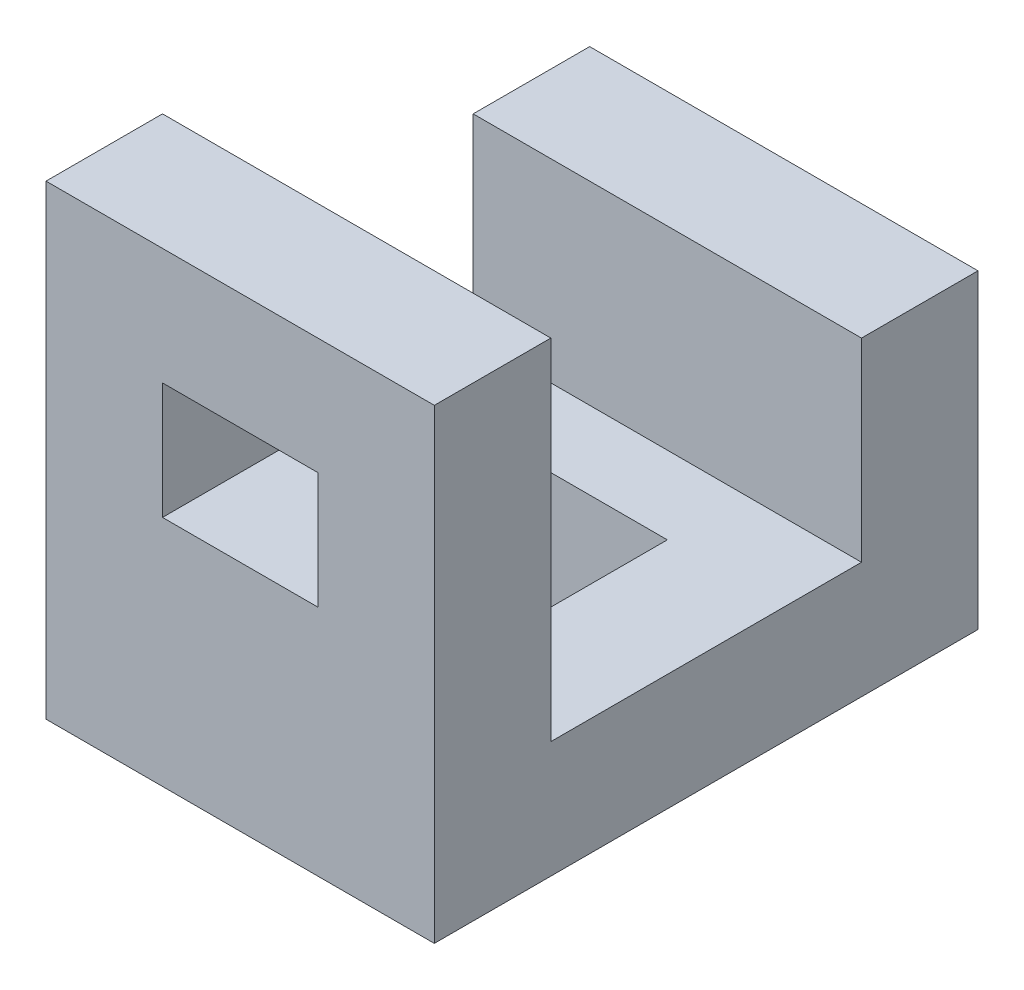
ISO-10303-21;
HEADER;
FILE_DESCRIPTION(('STEP AP214'),'2;1');
FILE_NAME('part.step','',(''),(''),'','','');
FILE_SCHEMA(('AUTOMOTIVE_DESIGN { 1 0 10303 214 1 1 1 1 }'));
ENDSEC;
DATA;
#1=APPLICATION_CONTEXT('core data for automotive mechanical design processes');
#2=APPLICATION_PROTOCOL_DEFINITION('international standard','automotive_design',2000,#1);
#3=PRODUCT_CONTEXT('',#1,'mechanical');
#4=PRODUCT('Part','Part','',(#3));
#5=PRODUCT_RELATED_PRODUCT_CATEGORY('part','',(#4));
#6=PRODUCT_DEFINITION_FORMATION('','',#4);
#7=PRODUCT_DEFINITION_CONTEXT('part definition',#1,'design');
#8=PRODUCT_DEFINITION('design','',#6,#7);
#9=PRODUCT_DEFINITION_SHAPE('','',#8);
#10=(LENGTH_UNIT() NAMED_UNIT(*) SI_UNIT(.MILLI.,.METRE.));
#11=(NAMED_UNIT(*) PLANE_ANGLE_UNIT() SI_UNIT($,.RADIAN.));
#12=(NAMED_UNIT(*) SI_UNIT($,.STERADIAN.) SOLID_ANGLE_UNIT());
#13=UNCERTAINTY_MEASURE_WITH_UNIT(LENGTH_MEASURE(1.E-05),#10,'distance_accuracy_value','');
#14=(GEOMETRIC_REPRESENTATION_CONTEXT(3) GLOBAL_UNCERTAINTY_ASSIGNED_CONTEXT((#13)) GLOBAL_UNIT_ASSIGNED_CONTEXT((#10,
#11,#12)) REPRESENTATION_CONTEXT('',''));
#15=CARTESIAN_POINT('',(0.,0.,0.));
#16=DIRECTION('',(0.,0.,1.));
#17=DIRECTION('',(1.,0.,0.));
#18=AXIS2_PLACEMENT_3D('',#15,#16,#17);
#19=CARTESIAN_POINT('',(0.,60.,-70.));
#20=DIRECTION('',(1.,0.,0.));
#21=DIRECTION('',(0.,0.,-1.));
#22=AXIS2_PLACEMENT_3D('',#19,#20,#21);
#23=PLANE('',#22);
#24=DIRECTION('',(0.,-1.,0.));
#25=VECTOR('',#24,1.);
#26=CARTESIAN_POINT('',(0.,15.,-55.));
#27=LINE('',#26,#25);
#28=CARTESIAN_POINT('',(0.,40.,-55.));
#29=VERTEX_POINT('',#28);
#30=CARTESIAN_POINT('',(0.,15.,-55.));
#31=VERTEX_POINT('',#30);
#32=EDGE_CURVE('E183',#29,#31,#27,.T.);
#33=ORIENTED_EDGE('',*,*,#32,.F.);
#34=DIRECTION('',(0.,0.,1.));
#35=VECTOR('',#34,1.);
#36=CARTESIAN_POINT('',(0.,40.,-55.));
#37=LINE('',#36,#35);
#38=CARTESIAN_POINT('',(0.,40.,-70.));
#39=VERTEX_POINT('',#38);
#40=EDGE_CURVE('E193',#39,#29,#37,.T.);
#41=ORIENTED_EDGE('',*,*,#40,.F.);
#42=DIRECTION('',(0.,-1.,0.));
#43=VECTOR('',#42,1.);
#44=CARTESIAN_POINT('',(0.,60.,-70.));
#45=LINE('',#44,#43);
#46=CARTESIAN_POINT('',(0.,0.,-70.));
#47=VERTEX_POINT('',#46);
#48=EDGE_CURVE('E286',#39,#47,#45,.T.);
#49=ORIENTED_EDGE('',*,*,#48,.T.);
#50=DIRECTION('',(0.,0.,1.));
#51=VECTOR('',#50,1.);
#52=CARTESIAN_POINT('',(0.,0.,-70.));
#53=LINE('',#52,#51);
#54=CARTESIAN_POINT('',(0.,0.,0.));
#55=VERTEX_POINT('',#54);
#56=EDGE_CURVE('E266',#47,#55,#53,.T.);
#57=ORIENTED_EDGE('',*,*,#56,.T.);
#58=DIRECTION('',(0.,-1.,0.));
#59=VECTOR('',#58,1.);
#60=CARTESIAN_POINT('',(0.,60.,0.));
#61=LINE('',#60,#59);
#62=CARTESIAN_POINT('',(0.,60.,0.));
#63=VERTEX_POINT('',#62);
#64=EDGE_CURVE('E309',#63,#55,#61,.T.);
#65=ORIENTED_EDGE('',*,*,#64,.F.);
#66=DIRECTION('',(0.,0.,1.));
#67=VECTOR('',#66,1.);
#68=CARTESIAN_POINT('',(0.,60.,-70.));
#69=LINE('',#68,#67);
#70=CARTESIAN_POINT('',(0.,60.,-15.));
#71=VERTEX_POINT('',#70);
#72=EDGE_CURVE('E275',#71,#63,#69,.T.);
#73=ORIENTED_EDGE('',*,*,#72,.F.);
#74=DIRECTION('',(0.,1.,0.));
#75=VECTOR('',#74,1.);
#76=CARTESIAN_POINT('',(0.,60.,-15.));
#77=LINE('',#76,#75);
#78=CARTESIAN_POINT('',(0.,15.,-15.));
#79=VERTEX_POINT('',#78);
#80=EDGE_CURVE('E213',#79,#71,#77,.T.);
#81=ORIENTED_EDGE('',*,*,#80,.F.);
#82=DIRECTION('',(0.,0.,1.));
#83=VECTOR('',#82,1.);
#84=CARTESIAN_POINT('',(0.,15.,-15.));
#85=LINE('',#84,#83);
#86=EDGE_CURVE('E209',#31,#79,#85,.T.);
#87=ORIENTED_EDGE('',*,*,#86,.F.);
#88=EDGE_LOOP('',(#33,#41,#49,#57,#65,#73,#81,#87));
#89=FACE_BOUND('',#88,.T.);
#90=ADVANCED_FACE('F39',(#89),#23,.F.);
#91=CARTESIAN_POINT('',(0.,60.,0.));
#92=DIRECTION('',(0.,0.,-1.));
#93=DIRECTION('',(-1.,0.,0.));
#94=AXIS2_PLACEMENT_3D('',#91,#92,#93);
#95=PLANE('',#94);
#96=DIRECTION('',(-1.,0.,0.));
#97=VECTOR('',#96,1.);
#98=CARTESIAN_POINT('',(35.,45.,0.));
#99=LINE('',#98,#97);
#100=CARTESIAN_POINT('',(35.,45.,0.));
#101=VERTEX_POINT('',#100);
#102=CARTESIAN_POINT('',(15.,45.,0.));
#103=VERTEX_POINT('',#102);
#104=EDGE_CURVE('E165',#101,#103,#99,.T.);
#105=ORIENTED_EDGE('',*,*,#104,.F.);
#106=DIRECTION('',(0.,1.,0.));
#107=VECTOR('',#106,1.);
#108=CARTESIAN_POINT('',(35.,30.,0.));
#109=LINE('',#108,#107);
#110=CARTESIAN_POINT('',(35.,30.,0.));
#111=VERTEX_POINT('',#110);
#112=EDGE_CURVE('E54',#111,#101,#109,.T.);
#113=ORIENTED_EDGE('',*,*,#112,.F.);
#114=DIRECTION('',(1.,0.,0.));
#115=VECTOR('',#114,1.);
#116=CARTESIAN_POINT('',(15.,30.,0.));
#117=LINE('',#116,#115);
#118=CARTESIAN_POINT('',(15.,30.,0.));
#119=VERTEX_POINT('',#118);
#120=EDGE_CURVE('E173',#119,#111,#117,.T.);
#121=ORIENTED_EDGE('',*,*,#120,.F.);
#122=DIRECTION('',(0.,-1.,0.));
#123=VECTOR('',#122,1.);
#124=CARTESIAN_POINT('',(15.,45.,0.));
#125=LINE('',#124,#123);
#126=EDGE_CURVE('E155',#103,#119,#125,.T.);
#127=ORIENTED_EDGE('',*,*,#126,.F.);
#128=EDGE_LOOP('',(#105,#113,#121,#127));
#129=FACE_BOUND('',#128,.T.);
#130=DIRECTION('',(1.,0.,0.));
#131=VECTOR('',#130,1.);
#132=CARTESIAN_POINT('',(0.,0.,0.));
#133=LINE('',#132,#131);
#134=CARTESIAN_POINT('',(50.,0.,0.));
#135=VERTEX_POINT('',#134);
#136=EDGE_CURVE('E290',#55,#135,#133,.T.);
#137=ORIENTED_EDGE('',*,*,#136,.T.);
#138=DIRECTION('',(0.,-1.,0.));
#139=VECTOR('',#138,1.);
#140=CARTESIAN_POINT('',(50.,60.,0.));
#141=LINE('',#140,#139);
#142=CARTESIAN_POINT('',(50.,60.,0.));
#143=VERTEX_POINT('',#142);
#144=EDGE_CURVE('E305',#143,#135,#141,.T.);
#145=ORIENTED_EDGE('',*,*,#144,.F.);
#146=DIRECTION('',(1.,0.,0.));
#147=VECTOR('',#146,1.);
#148=CARTESIAN_POINT('',(0.,60.,0.));
#149=LINE('',#148,#147);
#150=EDGE_CURVE('E278',#63,#143,#149,.T.);
#151=ORIENTED_EDGE('',*,*,#150,.F.);
#152=ORIENTED_EDGE('',*,*,#64,.T.);
#153=EDGE_LOOP('',(#137,#145,#151,#152));
#154=FACE_BOUND('',#153,.T.);
#155=ADVANCED_FACE('F170',(#129,#154),#95,.F.);
#156=CARTESIAN_POINT('',(50.,60.,0.));
#157=DIRECTION('',(-1.,0.,0.));
#158=DIRECTION('',(0.,0.,1.));
#159=AXIS2_PLACEMENT_3D('',#156,#157,#158);
#160=PLANE('',#159);
#161=DIRECTION('',(0.,-1.,0.));
#162=VECTOR('',#161,1.);
#163=CARTESIAN_POINT('',(50.,60.,-70.));
#164=LINE('',#163,#162);
#165=CARTESIAN_POINT('',(50.,40.,-70.));
#166=VERTEX_POINT('',#165);
#167=CARTESIAN_POINT('',(50.,0.,-70.));
#168=VERTEX_POINT('',#167);
#169=EDGE_CURVE('E302',#166,#168,#164,.T.);
#170=ORIENTED_EDGE('',*,*,#169,.F.);
#171=DIRECTION('',(0.,0.,1.));
#172=VECTOR('',#171,1.);
#173=CARTESIAN_POINT('',(50.,40.,-55.));
#174=LINE('',#173,#172);
#175=CARTESIAN_POINT('',(50.,40.,-55.));
#176=VERTEX_POINT('',#175);
#177=EDGE_CURVE('E201',#166,#176,#174,.T.);
#178=ORIENTED_EDGE('',*,*,#177,.T.);
#179=DIRECTION('',(0.,-1.,0.));
#180=VECTOR('',#179,1.);
#181=CARTESIAN_POINT('',(50.,15.,-55.));
#182=LINE('',#181,#180);
#183=CARTESIAN_POINT('',(50.,15.,-55.));
#184=VERTEX_POINT('',#183);
#185=EDGE_CURVE('E188',#176,#184,#182,.T.);
#186=ORIENTED_EDGE('',*,*,#185,.T.);
#187=DIRECTION('',(0.,0.,1.));
#188=VECTOR('',#187,1.);
#189=CARTESIAN_POINT('',(50.,15.,-15.));
#190=LINE('',#189,#188);
#191=CARTESIAN_POINT('',(50.,15.,-15.));
#192=VERTEX_POINT('',#191);
#193=EDGE_CURVE('E192',#184,#192,#190,.T.);
#194=ORIENTED_EDGE('',*,*,#193,.T.);
#195=DIRECTION('',(0.,1.,0.));
#196=VECTOR('',#195,1.);
#197=CARTESIAN_POINT('',(50.,60.,-15.));
#198=LINE('',#197,#196);
#199=CARTESIAN_POINT('',(50.,60.,-15.));
#200=VERTEX_POINT('',#199);
#201=EDGE_CURVE('E197',#192,#200,#198,.T.);
#202=ORIENTED_EDGE('',*,*,#201,.T.);
#203=DIRECTION('',(0.,0.,-1.));
#204=VECTOR('',#203,1.);
#205=CARTESIAN_POINT('',(50.,60.,0.));
#206=LINE('',#205,#204);
#207=EDGE_CURVE('E282',#143,#200,#206,.T.);
#208=ORIENTED_EDGE('',*,*,#207,.F.);
#209=ORIENTED_EDGE('',*,*,#144,.T.);
#210=DIRECTION('',(0.,0.,-1.));
#211=VECTOR('',#210,1.);
#212=CARTESIAN_POINT('',(50.,0.,0.));
#213=LINE('',#212,#211);
#214=EDGE_CURVE('E293',#135,#168,#213,.T.);
#215=ORIENTED_EDGE('',*,*,#214,.T.);
#216=EDGE_LOOP('',(#170,#178,#186,#194,#202,#208,#209,#215));
#217=FACE_BOUND('',#216,.T.);
#218=ADVANCED_FACE('F346',(#217),#160,.F.);
#219=CARTESIAN_POINT('',(50.,60.,-70.));
#220=DIRECTION('',(0.,0.,1.));
#221=DIRECTION('',(1.,0.,0.));
#222=AXIS2_PLACEMENT_3D('',#219,#220,#221);
#223=PLANE('',#222);
#224=ORIENTED_EDGE('',*,*,#48,.F.);
#225=DIRECTION('',(-1.,0.,0.));
#226=VECTOR('',#225,1.);
#227=CARTESIAN_POINT('',(50.,40.,-70.));
#228=LINE('',#227,#226);
#229=EDGE_CURVE('E223',#166,#39,#228,.T.);
#230=ORIENTED_EDGE('',*,*,#229,.F.);
#231=ORIENTED_EDGE('',*,*,#169,.T.);
#232=DIRECTION('',(-1.,0.,0.));
#233=VECTOR('',#232,1.);
#234=CARTESIAN_POINT('',(50.,0.,-70.));
#235=LINE('',#234,#233);
#236=EDGE_CURVE('E279',#168,#47,#235,.T.);
#237=ORIENTED_EDGE('',*,*,#236,.T.);
#238=EDGE_LOOP('',(#224,#230,#231,#237));
#239=FACE_BOUND('',#238,.T.);
#240=ADVANCED_FACE('F360',(#239),#223,.F.);
#241=CARTESIAN_POINT('',(0.,60.,0.));
#242=DIRECTION('',(0.,1.,0.));
#243=DIRECTION('',(0.,0.,1.));
#244=AXIS2_PLACEMENT_3D('',#241,#242,#243);
#245=PLANE('',#244);
#246=DIRECTION('',(-1.,0.,0.));
#247=VECTOR('',#246,1.);
#248=CARTESIAN_POINT('',(50.,60.,-15.));
#249=LINE('',#248,#247);
#250=EDGE_CURVE('E226',#200,#71,#249,.T.);
#251=ORIENTED_EDGE('',*,*,#250,.T.);
#252=ORIENTED_EDGE('',*,*,#72,.T.);
#253=ORIENTED_EDGE('',*,*,#150,.T.);
#254=ORIENTED_EDGE('',*,*,#207,.T.);
#255=EDGE_LOOP('',(#251,#252,#253,#254));
#256=FACE_BOUND('',#255,.T.);
#257=ADVANCED_FACE('F373',(#256),#245,.T.);
#258=CARTESIAN_POINT('',(0.,0.,0.));
#259=DIRECTION('',(0.,1.,0.));
#260=DIRECTION('',(0.,0.,1.));
#261=AXIS2_PLACEMENT_3D('',#258,#259,#260);
#262=PLANE('',#261);
#263=DIRECTION('',(0.,0.,-1.));
#264=VECTOR('',#263,1.);
#265=CARTESIAN_POINT('',(15.,0.,-25.));
#266=LINE('',#265,#264);
#267=CARTESIAN_POINT('',(15.,0.,-25.));
#268=VERTEX_POINT('',#267);
#269=CARTESIAN_POINT('',(15.,0.,-45.));
#270=VERTEX_POINT('',#269);
#271=EDGE_CURVE('E250',#268,#270,#266,.T.);
#272=ORIENTED_EDGE('',*,*,#271,.F.);
#273=DIRECTION('',(-1.,0.,0.));
#274=VECTOR('',#273,1.);
#275=CARTESIAN_POINT('',(35.,0.,-25.));
#276=LINE('',#275,#274);
#277=CARTESIAN_POINT('',(35.,0.,-25.));
#278=VERTEX_POINT('',#277);
#279=EDGE_CURVE('E246',#278,#268,#276,.T.);
#280=ORIENTED_EDGE('',*,*,#279,.F.);
#281=DIRECTION('',(0.,0.,1.));
#282=VECTOR('',#281,1.);
#283=CARTESIAN_POINT('',(35.,0.,-45.));
#284=LINE('',#283,#282);
#285=CARTESIAN_POINT('',(35.,0.,-45.));
#286=VERTEX_POINT('',#285);
#287=EDGE_CURVE('E258',#286,#278,#284,.T.);
#288=ORIENTED_EDGE('',*,*,#287,.F.);
#289=DIRECTION('',(1.,0.,0.));
#290=VECTOR('',#289,1.);
#291=CARTESIAN_POINT('',(15.,0.,-45.));
#292=LINE('',#291,#290);
#293=EDGE_CURVE('E254',#270,#286,#292,.T.);
#294=ORIENTED_EDGE('',*,*,#293,.F.);
#295=EDGE_LOOP('',(#272,#280,#288,#294));
#296=FACE_BOUND('',#295,.T.);
#297=ORIENTED_EDGE('',*,*,#56,.F.);
#298=ORIENTED_EDGE('',*,*,#236,.F.);
#299=ORIENTED_EDGE('',*,*,#214,.F.);
#300=ORIENTED_EDGE('',*,*,#136,.F.);
#301=EDGE_LOOP('',(#297,#298,#299,#300));
#302=FACE_BOUND('',#301,.T.);
#303=ADVANCED_FACE('F368',(#296,#302),#262,.F.);
#304=CARTESIAN_POINT('',(35.,60.,-25.));
#305=DIRECTION('',(0.,0.,1.));
#306=DIRECTION('',(1.,0.,0.));
#307=AXIS2_PLACEMENT_3D('',#304,#305,#306);
#308=PLANE('',#307);
#309=DIRECTION('',(0.,-1.,0.));
#310=VECTOR('',#309,1.);
#311=CARTESIAN_POINT('',(15.,60.,-25.));
#312=LINE('',#311,#310);
#313=CARTESIAN_POINT('',(15.,15.,-25.));
#314=VERTEX_POINT('',#313);
#315=EDGE_CURVE('E262',#314,#268,#312,.T.);
#316=ORIENTED_EDGE('',*,*,#315,.F.);
#317=DIRECTION('',(1.,0.,0.));
#318=VECTOR('',#317,1.);
#319=CARTESIAN_POINT('',(35.,15.,-25.));
#320=LINE('',#319,#318);
#321=CARTESIAN_POINT('',(35.,15.,-25.));
#322=VERTEX_POINT('',#321);
#323=EDGE_CURVE('E242',#314,#322,#320,.T.);
#324=ORIENTED_EDGE('',*,*,#323,.T.);
#325=DIRECTION('',(0.,-1.,0.));
#326=VECTOR('',#325,1.);
#327=CARTESIAN_POINT('',(35.,60.,-25.));
#328=LINE('',#327,#326);
#329=EDGE_CURVE('E263',#322,#278,#328,.T.);
#330=ORIENTED_EDGE('',*,*,#329,.T.);
#331=ORIENTED_EDGE('',*,*,#279,.T.);
#332=EDGE_LOOP('',(#316,#324,#330,#331));
#333=FACE_BOUND('',#332,.T.);
#334=ADVANCED_FACE('F396',(#333),#308,.F.);
#335=CARTESIAN_POINT('',(35.,60.,-45.));
#336=DIRECTION('',(1.,0.,0.));
#337=DIRECTION('',(0.,0.,-1.));
#338=AXIS2_PLACEMENT_3D('',#335,#336,#337);
#339=PLANE('',#338);
#340=ORIENTED_EDGE('',*,*,#329,.F.);
#341=DIRECTION('',(0.,0.,-1.));
#342=VECTOR('',#341,1.);
#343=CARTESIAN_POINT('',(35.,15.,-45.));
#344=LINE('',#343,#342);
#345=CARTESIAN_POINT('',(35.,15.,-45.));
#346=VERTEX_POINT('',#345);
#347=EDGE_CURVE('E238',#322,#346,#344,.T.);
#348=ORIENTED_EDGE('',*,*,#347,.T.);
#349=DIRECTION('',(0.,-1.,0.));
#350=VECTOR('',#349,1.);
#351=CARTESIAN_POINT('',(35.,60.,-45.));
#352=LINE('',#351,#350);
#353=EDGE_CURVE('E267',#346,#286,#352,.T.);
#354=ORIENTED_EDGE('',*,*,#353,.T.);
#355=ORIENTED_EDGE('',*,*,#287,.T.);
#356=EDGE_LOOP('',(#340,#348,#354,#355));
#357=FACE_BOUND('',#356,.T.);
#358=ADVANCED_FACE('F394',(#357),#339,.F.);
#359=CARTESIAN_POINT('',(15.,60.,-45.));
#360=DIRECTION('',(0.,0.,-1.));
#361=DIRECTION('',(-1.,0.,0.));
#362=AXIS2_PLACEMENT_3D('',#359,#360,#361);
#363=PLANE('',#362);
#364=ORIENTED_EDGE('',*,*,#353,.F.);
#365=DIRECTION('',(-1.,0.,0.));
#366=VECTOR('',#365,1.);
#367=CARTESIAN_POINT('',(15.,15.,-45.));
#368=LINE('',#367,#366);
#369=CARTESIAN_POINT('',(15.,15.,-45.));
#370=VERTEX_POINT('',#369);
#371=EDGE_CURVE('E222',#346,#370,#368,.T.);
#372=ORIENTED_EDGE('',*,*,#371,.T.);
#373=DIRECTION('',(0.,-1.,0.));
#374=VECTOR('',#373,1.);
#375=CARTESIAN_POINT('',(15.,60.,-45.));
#376=LINE('',#375,#374);
#377=EDGE_CURVE('E270',#370,#270,#376,.T.);
#378=ORIENTED_EDGE('',*,*,#377,.T.);
#379=ORIENTED_EDGE('',*,*,#293,.T.);
#380=EDGE_LOOP('',(#364,#372,#378,#379));
#381=FACE_BOUND('',#380,.T.);
#382=ADVANCED_FACE('F386',(#381),#363,.F.);
#383=CARTESIAN_POINT('',(15.,60.,-25.));
#384=DIRECTION('',(-1.,0.,0.));
#385=DIRECTION('',(0.,0.,1.));
#386=AXIS2_PLACEMENT_3D('',#383,#384,#385);
#387=PLANE('',#386);
#388=ORIENTED_EDGE('',*,*,#377,.F.);
#389=DIRECTION('',(0.,0.,1.));
#390=VECTOR('',#389,1.);
#391=CARTESIAN_POINT('',(15.,15.,-25.));
#392=LINE('',#391,#390);
#393=EDGE_CURVE('E313',#370,#314,#392,.T.);
#394=ORIENTED_EDGE('',*,*,#393,.T.);
#395=ORIENTED_EDGE('',*,*,#315,.T.);
#396=ORIENTED_EDGE('',*,*,#271,.T.);
#397=EDGE_LOOP('',(#388,#394,#395,#396));
#398=FACE_BOUND('',#397,.T.);
#399=ADVANCED_FACE('F379',(#398),#387,.F.);
#400=CARTESIAN_POINT('',(50.,15.,-15.));
#401=DIRECTION('',(0.,-1.,0.));
#402=DIRECTION('',(0.,0.,-1.));
#403=AXIS2_PLACEMENT_3D('',#400,#401,#402);
#404=PLANE('',#403);
#405=ORIENTED_EDGE('',*,*,#86,.T.);
#406=DIRECTION('',(-1.,0.,0.));
#407=VECTOR('',#406,1.);
#408=CARTESIAN_POINT('',(50.,15.,-15.));
#409=LINE('',#408,#407);
#410=EDGE_CURVE('E230',#192,#79,#409,.T.);
#411=ORIENTED_EDGE('',*,*,#410,.F.);
#412=ORIENTED_EDGE('',*,*,#193,.F.);
#413=DIRECTION('',(-1.,0.,0.));
#414=VECTOR('',#413,1.);
#415=CARTESIAN_POINT('',(50.,15.,-55.));
#416=LINE('',#415,#414);
#417=EDGE_CURVE('E205',#184,#31,#416,.T.);
#418=ORIENTED_EDGE('',*,*,#417,.T.);
#419=EDGE_LOOP('',(#405,#411,#412,#418));
#420=FACE_BOUND('',#419,.T.);
#421=ORIENTED_EDGE('',*,*,#393,.F.);
#422=ORIENTED_EDGE('',*,*,#371,.F.);
#423=ORIENTED_EDGE('',*,*,#347,.F.);
#424=ORIENTED_EDGE('',*,*,#323,.F.);
#425=EDGE_LOOP('',(#421,#422,#423,#424));
#426=FACE_BOUND('',#425,.T.);
#427=ADVANCED_FACE('F376',(#420,#426),#404,.F.);
#428=CARTESIAN_POINT('',(50.,15.,-55.));
#429=DIRECTION('',(0.,0.,-1.));
#430=DIRECTION('',(-1.,0.,0.));
#431=AXIS2_PLACEMENT_3D('',#428,#429,#430);
#432=PLANE('',#431);
#433=ORIENTED_EDGE('',*,*,#32,.T.);
#434=ORIENTED_EDGE('',*,*,#417,.F.);
#435=ORIENTED_EDGE('',*,*,#185,.F.);
#436=DIRECTION('',(-1.,0.,0.));
#437=VECTOR('',#436,1.);
#438=CARTESIAN_POINT('',(50.,40.,-55.));
#439=LINE('',#438,#437);
#440=EDGE_CURVE('E219',#176,#29,#439,.T.);
#441=ORIENTED_EDGE('',*,*,#440,.T.);
#442=EDGE_LOOP('',(#433,#434,#435,#441));
#443=FACE_BOUND('',#442,.T.);
#444=ADVANCED_FACE('F353',(#443),#432,.F.);
#445=CARTESIAN_POINT('',(50.,40.,-55.));
#446=DIRECTION('',(0.,-1.,0.));
#447=DIRECTION('',(0.,0.,-1.));
#448=AXIS2_PLACEMENT_3D('',#445,#446,#447);
#449=PLANE('',#448);
#450=ORIENTED_EDGE('',*,*,#40,.T.);
#451=ORIENTED_EDGE('',*,*,#440,.F.);
#452=ORIENTED_EDGE('',*,*,#177,.F.);
#453=ORIENTED_EDGE('',*,*,#229,.T.);
#454=EDGE_LOOP('',(#450,#451,#452,#453));
#455=FACE_BOUND('',#454,.T.);
#456=ADVANCED_FACE('F337',(#455),#449,.F.);
#457=CARTESIAN_POINT('',(50.,60.,-15.));
#458=DIRECTION('',(0.,0.,1.));
#459=DIRECTION('',(0.,-1.,0.));
#460=AXIS2_PLACEMENT_3D('',#457,#458,#459);
#461=PLANE('',#460);
#462=DIRECTION('',(1.,0.,0.));
#463=VECTOR('',#462,1.);
#464=CARTESIAN_POINT('',(50.,30.,-15.));
#465=LINE('',#464,#463);
#466=CARTESIAN_POINT('',(15.,30.,-15.));
#467=VERTEX_POINT('',#466);
#468=CARTESIAN_POINT('',(35.,30.,-15.));
#469=VERTEX_POINT('',#468);
#470=EDGE_CURVE('E47',#467,#469,#465,.T.);
#471=ORIENTED_EDGE('',*,*,#470,.T.);
#472=DIRECTION('',(0.,1.,0.));
#473=VECTOR('',#472,1.);
#474=CARTESIAN_POINT('',(35.,60.,-15.));
#475=LINE('',#474,#473);
#476=CARTESIAN_POINT('',(35.,45.,-15.));
#477=VERTEX_POINT('',#476);
#478=EDGE_CURVE('E11',#469,#477,#475,.T.);
#479=ORIENTED_EDGE('',*,*,#478,.T.);
#480=DIRECTION('',(-1.,0.,0.));
#481=VECTOR('',#480,1.);
#482=CARTESIAN_POINT('',(50.,45.,-15.));
#483=LINE('',#482,#481);
#484=CARTESIAN_POINT('',(15.,45.,-15.));
#485=VERTEX_POINT('',#484);
#486=EDGE_CURVE('E317',#477,#485,#483,.T.);
#487=ORIENTED_EDGE('',*,*,#486,.T.);
#488=DIRECTION('',(0.,-1.,0.));
#489=VECTOR('',#488,1.);
#490=CARTESIAN_POINT('',(15.,60.,-15.));
#491=LINE('',#490,#489);
#492=EDGE_CURVE('E158',#485,#467,#491,.T.);
#493=ORIENTED_EDGE('',*,*,#492,.T.);
#494=EDGE_LOOP('',(#471,#479,#487,#493));
#495=FACE_BOUND('',#494,.T.);
#496=ORIENTED_EDGE('',*,*,#80,.T.);
#497=ORIENTED_EDGE('',*,*,#250,.F.);
#498=ORIENTED_EDGE('',*,*,#201,.F.);
#499=ORIENTED_EDGE('',*,*,#410,.T.);
#500=EDGE_LOOP('',(#496,#497,#498,#499));
#501=FACE_BOUND('',#500,.T.);
#502=ADVANCED_FACE('F324',(#495,#501),#461,.F.);
#503=CARTESIAN_POINT('',(35.,30.,-50.));
#504=DIRECTION('',(1.,0.,0.));
#505=DIRECTION('',(0.,1.,0.));
#506=AXIS2_PLACEMENT_3D('',#503,#504,#505);
#507=PLANE('',#506);
#508=DIRECTION('',(0.,0.,1.));
#509=VECTOR('',#508,1.);
#510=CARTESIAN_POINT('',(35.,30.,-50.));
#511=LINE('',#510,#509);
#512=EDGE_CURVE('E180',#469,#111,#511,.T.);
#513=ORIENTED_EDGE('',*,*,#512,.T.);
#514=ORIENTED_EDGE('',*,*,#112,.T.);
#515=DIRECTION('',(0.,0.,1.));
#516=VECTOR('',#515,1.);
#517=CARTESIAN_POINT('',(35.,45.,-50.));
#518=LINE('',#517,#516);
#519=EDGE_CURVE('E162',#477,#101,#518,.T.);
#520=ORIENTED_EDGE('',*,*,#519,.F.);
#521=ORIENTED_EDGE('',*,*,#478,.F.);
#522=EDGE_LOOP('',(#513,#514,#520,#521));
#523=FACE_BOUND('',#522,.T.);
#524=ADVANCED_FACE('F329',(#523),#507,.F.);
#525=CARTESIAN_POINT('',(15.,30.,-50.));
#526=DIRECTION('',(0.,-1.,0.));
#527=DIRECTION('',(1.,0.,0.));
#528=AXIS2_PLACEMENT_3D('',#525,#526,#527);
#529=PLANE('',#528);
#530=DIRECTION('',(0.,0.,1.));
#531=VECTOR('',#530,1.);
#532=CARTESIAN_POINT('',(15.,30.,-50.));
#533=LINE('',#532,#531);
#534=EDGE_CURVE('E161',#467,#119,#533,.T.);
#535=ORIENTED_EDGE('',*,*,#534,.T.);
#536=ORIENTED_EDGE('',*,*,#120,.T.);
#537=ORIENTED_EDGE('',*,*,#512,.F.);
#538=ORIENTED_EDGE('',*,*,#470,.F.);
#539=EDGE_LOOP('',(#535,#536,#537,#538));
#540=FACE_BOUND('',#539,.T.);
#541=ADVANCED_FACE('F328',(#540),#529,.F.);
#542=CARTESIAN_POINT('',(15.,45.,-50.));
#543=DIRECTION('',(-1.,0.,0.));
#544=DIRECTION('',(0.,0.,1.));
#545=AXIS2_PLACEMENT_3D('',#542,#543,#544);
#546=PLANE('',#545);
#547=DIRECTION('',(0.,0.,1.));
#548=VECTOR('',#547,1.);
#549=CARTESIAN_POINT('',(15.,45.,-50.));
#550=LINE('',#549,#548);
#551=EDGE_CURVE('E62',#485,#103,#550,.T.);
#552=ORIENTED_EDGE('',*,*,#551,.T.);
#553=ORIENTED_EDGE('',*,*,#126,.T.);
#554=ORIENTED_EDGE('',*,*,#534,.F.);
#555=ORIENTED_EDGE('',*,*,#492,.F.);
#556=EDGE_LOOP('',(#552,#553,#554,#555));
#557=FACE_BOUND('',#556,.T.);
#558=ADVANCED_FACE('F152',(#557),#546,.F.);
#559=CARTESIAN_POINT('',(35.,45.,-50.));
#560=DIRECTION('',(0.,1.,0.));
#561=DIRECTION('',(0.,0.,1.));
#562=AXIS2_PLACEMENT_3D('',#559,#560,#561);
#563=PLANE('',#562);
#564=ORIENTED_EDGE('',*,*,#519,.T.);
#565=ORIENTED_EDGE('',*,*,#104,.T.);
#566=ORIENTED_EDGE('',*,*,#551,.F.);
#567=ORIENTED_EDGE('',*,*,#486,.F.);
#568=EDGE_LOOP('',(#564,#565,#566,#567));
#569=FACE_BOUND('',#568,.T.);
#570=ADVANCED_FACE('F166',(#569),#563,.F.);
#571=CLOSED_SHELL('',(#90,#155,#218,#240,#257,#303,#334,#358,#382,#399,#427,#444,#456,#502,#524,
#541,#558,#570));
#572=MANIFOLD_SOLID_BREP('B2',#571);
#573=ADVANCED_BREP_SHAPE_REPRESENTATION('',(#18,#572),#14);
#574=SHAPE_DEFINITION_REPRESENTATION(#9,#573);
ENDSEC;
END-ISO-10303-21;
